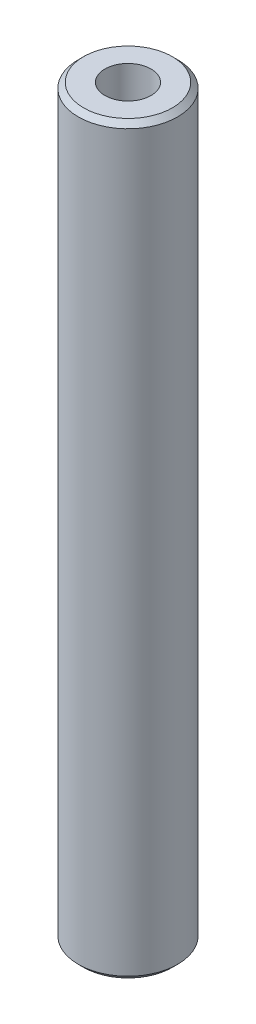
ISO-10303-21;
HEADER;
FILE_DESCRIPTION(('STEP AP214'),'2;1');
FILE_NAME('part.step','',(''),(''),'','','');
FILE_SCHEMA(('AUTOMOTIVE_DESIGN { 1 0 10303 214 1 1 1 1 }'));
ENDSEC;
DATA;
#1=APPLICATION_CONTEXT('core data for automotive mechanical design processes');
#2=APPLICATION_PROTOCOL_DEFINITION('international standard','automotive_design',2000,#1);
#3=PRODUCT_CONTEXT('',#1,'mechanical');
#4=PRODUCT('Part','Part','',(#3));
#5=PRODUCT_RELATED_PRODUCT_CATEGORY('part','',(#4));
#6=PRODUCT_DEFINITION_FORMATION('','',#4);
#7=PRODUCT_DEFINITION_CONTEXT('part definition',#1,'design');
#8=PRODUCT_DEFINITION('design','',#6,#7);
#9=PRODUCT_DEFINITION_SHAPE('','',#8);
#10=(LENGTH_UNIT() NAMED_UNIT(*) SI_UNIT(.MILLI.,.METRE.));
#11=(NAMED_UNIT(*) PLANE_ANGLE_UNIT() SI_UNIT($,.RADIAN.));
#12=(NAMED_UNIT(*) SI_UNIT($,.STERADIAN.) SOLID_ANGLE_UNIT());
#13=UNCERTAINTY_MEASURE_WITH_UNIT(LENGTH_MEASURE(1.E-05),#10,'distance_accuracy_value','');
#14=(GEOMETRIC_REPRESENTATION_CONTEXT(3) GLOBAL_UNCERTAINTY_ASSIGNED_CONTEXT((#13)) GLOBAL_UNIT_ASSIGNED_CONTEXT((#10,
#11,#12)) REPRESENTATION_CONTEXT('',''));
#15=CARTESIAN_POINT('',(0.,0.,0.));
#16=DIRECTION('',(0.,0.,1.));
#17=DIRECTION('',(1.,0.,0.));
#18=AXIS2_PLACEMENT_3D('',#15,#16,#17);
#19=CARTESIAN_POINT('',(0.,600.,0.));
#20=DIRECTION('',(0.,-1.,0.));
#21=DIRECTION('',(0.,0.,-1.));
#22=AXIS2_PLACEMENT_3D('',#19,#20,#21);
#23=CYLINDRICAL_SURFACE('',#22,40.);
#24=CARTESIAN_POINT('',(0.,595.780175828948,0.));
#25=DIRECTION('',(0.,1.,0.));
#26=DIRECTION('',(0.,0.,1.));
#27=AXIS2_PLACEMENT_3D('',#24,#25,#26);
#28=CIRCLE('',#27,40.);
#29=CARTESIAN_POINT('',(0.,595.780175828948,40.));
#30=VERTEX_POINT('',#29);
#31=EDGE_CURVE('E50',#30,#30,#28,.F.);
#32=ORIENTED_EDGE('',*,*,#31,.T.);
#33=EDGE_LOOP('',(#32));
#34=FACE_BOUND('',#33,.T.);
#35=CARTESIAN_POINT('',(0.,4.21982417105193,0.));
#36=DIRECTION('',(0.,1.,0.));
#37=DIRECTION('',(0.,0.,1.));
#38=AXIS2_PLACEMENT_3D('',#35,#36,#37);
#39=CIRCLE('',#38,40.);
#40=CARTESIAN_POINT('',(0.,4.21982417105193,40.));
#41=VERTEX_POINT('',#40);
#42=EDGE_CURVE('E51',#41,#41,#39,.T.);
#43=ORIENTED_EDGE('',*,*,#42,.T.);
#44=EDGE_LOOP('',(#43));
#45=FACE_BOUND('',#44,.T.);
#46=ADVANCED_FACE('F39',(#34,#45),#23,.T.);
#47=CARTESIAN_POINT('',(0.,600.,0.));
#48=DIRECTION('',(0.,1.,0.));
#49=DIRECTION('',(0.,0.,1.));
#50=AXIS2_PLACEMENT_3D('',#47,#48,#49);
#51=PLANE('',#50);
#52=CARTESIAN_POINT('',(0.,600.,0.));
#53=DIRECTION('',(0.,1.,0.));
#54=DIRECTION('',(0.,0.,1.));
#55=AXIS2_PLACEMENT_3D('',#52,#53,#54);
#56=CIRCLE('',#55,35.780175828948);
#57=CARTESIAN_POINT('',(0.,600.,35.780175828948));
#58=VERTEX_POINT('',#57);
#59=EDGE_CURVE('E54',#58,#58,#56,.T.);
#60=ORIENTED_EDGE('',*,*,#59,.T.);
#61=EDGE_LOOP('',(#60));
#62=FACE_BOUND('',#61,.T.);
#63=CARTESIAN_POINT('',(0.,600.,0.));
#64=DIRECTION('',(0.,1.,0.));
#65=DIRECTION('',(0.,0.,1.));
#66=AXIS2_PLACEMENT_3D('',#63,#64,#65);
#67=CIRCLE('',#66,18.5778133769236);
#68=CARTESIAN_POINT('',(0.,600.,18.5778133769236));
#69=VERTEX_POINT('',#68);
#70=EDGE_CURVE('E58',#69,#69,#67,.T.);
#71=ORIENTED_EDGE('',*,*,#70,.F.);
#72=EDGE_LOOP('',(#71));
#73=FACE_BOUND('',#72,.T.);
#74=ADVANCED_FACE('F69',(#62,#73),#51,.T.);
#75=CARTESIAN_POINT('',(0.,0.,0.));
#76=DIRECTION('',(0.,1.,0.));
#77=DIRECTION('',(0.,0.,1.));
#78=AXIS2_PLACEMENT_3D('',#75,#76,#77);
#79=PLANE('',#78);
#80=CARTESIAN_POINT('',(0.,0.,0.));
#81=DIRECTION('',(0.,1.,0.));
#82=DIRECTION('',(0.,0.,1.));
#83=AXIS2_PLACEMENT_3D('',#80,#81,#82);
#84=CIRCLE('',#83,35.780175828948);
#85=CARTESIAN_POINT('',(0.,0.,35.780175828948));
#86=VERTEX_POINT('',#85);
#87=EDGE_CURVE('E10',#86,#86,#84,.F.);
#88=ORIENTED_EDGE('',*,*,#87,.T.);
#89=EDGE_LOOP('',(#88));
#90=FACE_BOUND('',#89,.T.);
#91=CARTESIAN_POINT('',(0.,0.,0.));
#92=DIRECTION('',(0.,1.,0.));
#93=DIRECTION('',(0.,0.,1.));
#94=AXIS2_PLACEMENT_3D('',#91,#92,#93);
#95=CIRCLE('',#94,18.5778133769236);
#96=CARTESIAN_POINT('',(0.,0.,18.5778133769236));
#97=VERTEX_POINT('',#96);
#98=EDGE_CURVE('E63',#97,#97,#95,.T.);
#99=ORIENTED_EDGE('',*,*,#98,.T.);
#100=EDGE_LOOP('',(#99));
#101=FACE_BOUND('',#100,.T.);
#102=ADVANCED_FACE('F75',(#90,#101),#79,.F.);
#103=CARTESIAN_POINT('',(0.,600.,0.));
#104=DIRECTION('',(0.,-1.,0.));
#105=DIRECTION('',(0.,0.,-1.));
#106=AXIS2_PLACEMENT_3D('',#103,#104,#105);
#107=CYLINDRICAL_SURFACE('',#106,18.5778133769236);
#108=ORIENTED_EDGE('',*,*,#70,.T.);
#109=EDGE_LOOP('',(#108));
#110=FACE_BOUND('',#109,.T.);
#111=ORIENTED_EDGE('',*,*,#98,.F.);
#112=EDGE_LOOP('',(#111));
#113=FACE_BOUND('',#112,.T.);
#114=ADVANCED_FACE('F70',(#110,#113),#107,.F.);
#115=CARTESIAN_POINT('',(0.,600.,0.));
#116=DIRECTION('',(0.,-1.,0.));
#117=DIRECTION('',(0.,0.,-1.));
#118=AXIS2_PLACEMENT_3D('',#115,#116,#117);
#119=CONICAL_SURFACE('',#118,35.780175828948,0.785398163397451);
#120=ORIENTED_EDGE('',*,*,#31,.F.);
#121=EDGE_LOOP('',(#120));
#122=FACE_BOUND('',#121,.T.);
#123=ORIENTED_EDGE('',*,*,#59,.F.);
#124=EDGE_LOOP('',(#123));
#125=FACE_BOUND('',#124,.T.);
#126=ADVANCED_FACE('F81',(#122,#125),#119,.T.);
#127=CARTESIAN_POINT('',(0.,4.21982417105193,0.));
#128=DIRECTION('',(0.,1.,0.));
#129=DIRECTION('',(0.,0.,1.));
#130=AXIS2_PLACEMENT_3D('',#127,#128,#129);
#131=CONICAL_SURFACE('',#130,40.,0.785398163397451);
#132=ORIENTED_EDGE('',*,*,#87,.F.);
#133=EDGE_LOOP('',(#132));
#134=FACE_BOUND('',#133,.T.);
#135=ORIENTED_EDGE('',*,*,#42,.F.);
#136=EDGE_LOOP('',(#135));
#137=FACE_BOUND('',#136,.T.);
#138=ADVANCED_FACE('F45',(#134,#137),#131,.T.);
#139=CLOSED_SHELL('',(#46,#74,#102,#114,#126,#138));
#140=MANIFOLD_SOLID_BREP('B2',#139);
#141=ADVANCED_BREP_SHAPE_REPRESENTATION('',(#18,#140),#14);
#142=SHAPE_DEFINITION_REPRESENTATION(#9,#141);
ENDSEC;
END-ISO-10303-21;
